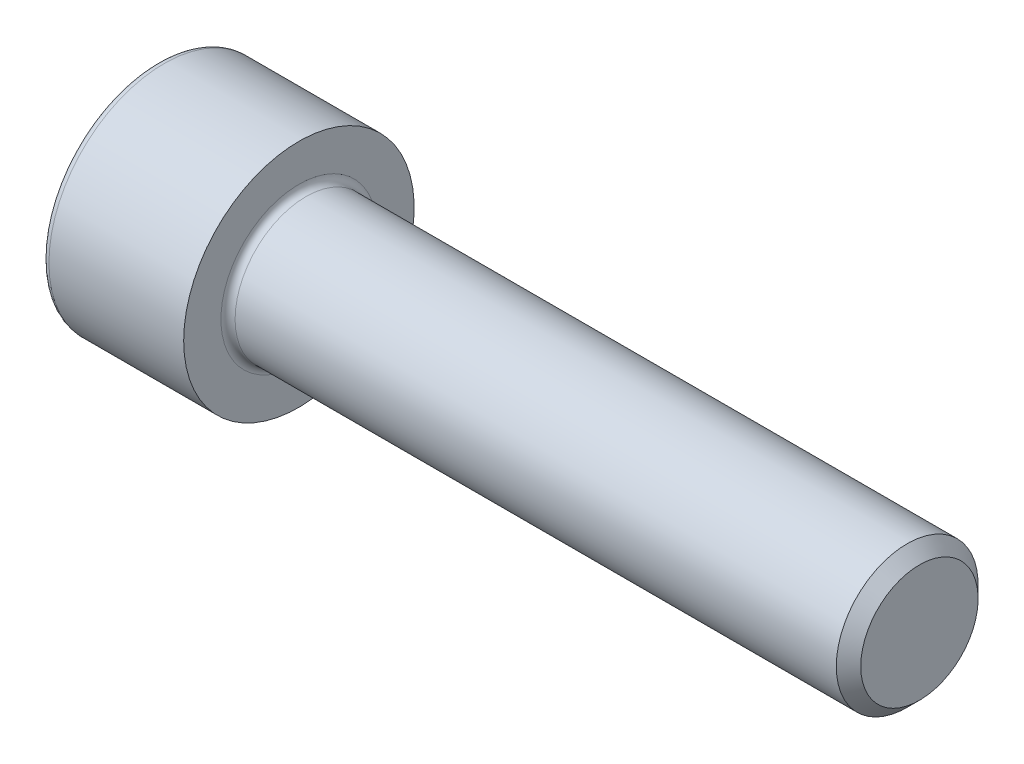
ISO-10303-21;
HEADER;
FILE_DESCRIPTION(('STEP AP214'),'2;1');
FILE_NAME('part.step','',(''),(''),'','','');
FILE_SCHEMA(('AUTOMOTIVE_DESIGN { 1 0 10303 214 1 1 1 1 }'));
ENDSEC;
DATA;
#1=APPLICATION_CONTEXT('core data for automotive mechanical design processes');
#2=APPLICATION_PROTOCOL_DEFINITION('international standard','automotive_design',2000,#1);
#3=PRODUCT_CONTEXT('',#1,'mechanical');
#4=PRODUCT('Part','Part','',(#3));
#5=PRODUCT_RELATED_PRODUCT_CATEGORY('part','',(#4));
#6=PRODUCT_DEFINITION_FORMATION('','',#4);
#7=PRODUCT_DEFINITION_CONTEXT('part definition',#1,'design');
#8=PRODUCT_DEFINITION('design','',#6,#7);
#9=PRODUCT_DEFINITION_SHAPE('','',#8);
#10=(LENGTH_UNIT() NAMED_UNIT(*) SI_UNIT(.MILLI.,.METRE.));
#11=(NAMED_UNIT(*) PLANE_ANGLE_UNIT() SI_UNIT($,.RADIAN.));
#12=(NAMED_UNIT(*) SI_UNIT($,.STERADIAN.) SOLID_ANGLE_UNIT());
#13=UNCERTAINTY_MEASURE_WITH_UNIT(LENGTH_MEASURE(1.E-05),#10,'distance_accuracy_value','');
#14=(GEOMETRIC_REPRESENTATION_CONTEXT(3) GLOBAL_UNCERTAINTY_ASSIGNED_CONTEXT((#13)) GLOBAL_UNIT_ASSIGNED_CONTEXT((#10,
#11,#12)) REPRESENTATION_CONTEXT('',''));
#15=CARTESIAN_POINT('',(0.,0.,0.));
#16=DIRECTION('',(0.,0.,1.));
#17=DIRECTION('',(1.,0.,0.));
#18=AXIS2_PLACEMENT_3D('',#15,#16,#17);
#19=CARTESIAN_POINT('',(0.,0.,0.));
#20=DIRECTION('',(-1.,0.,0.));
#21=DIRECTION('',(0.,0.,1.));
#22=AXIS2_PLACEMENT_3D('',#19,#20,#21);
#23=PLANE('',#22);
#24=DIRECTION('',(0.,-0.499999999999999,0.866025403784439));
#25=VECTOR('',#24,1.);
#26=CARTESIAN_POINT('',(0.,3.51894989071077,0.));
#27=LINE('',#26,#25);
#28=CARTESIAN_POINT('',(0.,3.51894989071077,0.));
#29=VERTEX_POINT('',#28);
#30=CARTESIAN_POINT('',(0.,1.75947494535538,3.0475));
#31=VERTEX_POINT('',#30);
#32=EDGE_CURVE('E258',#29,#31,#27,.T.);
#33=ORIENTED_EDGE('',*,*,#32,.T.);
#34=DIRECTION('',(0.,1.,0.));
#35=VECTOR('',#34,1.);
#36=CARTESIAN_POINT('',(0.,-1.75947494535539,3.0475));
#37=LINE('',#36,#35);
#38=CARTESIAN_POINT('',(0.,-1.75947494535539,3.0475));
#39=VERTEX_POINT('',#38);
#40=EDGE_CURVE('E130',#39,#31,#37,.T.);
#41=ORIENTED_EDGE('',*,*,#40,.F.);
#42=DIRECTION('',(0.,-0.500000000000001,-0.866025403784438));
#43=VECTOR('',#42,1.);
#44=CARTESIAN_POINT('',(0.,-1.75947494535539,3.0475));
#45=LINE('',#44,#43);
#46=CARTESIAN_POINT('',(0.,-3.51894989071077,0.));
#47=VERTEX_POINT('',#46);
#48=EDGE_CURVE('E261',#39,#47,#45,.T.);
#49=ORIENTED_EDGE('',*,*,#48,.T.);
#50=DIRECTION('',(0.,0.499999999999999,-0.866025403784439));
#51=VECTOR('',#50,1.);
#52=CARTESIAN_POINT('',(0.,-3.51894989071077,0.));
#53=LINE('',#52,#51);
#54=CARTESIAN_POINT('',(0.,-1.75947494535539,-3.0475));
#55=VERTEX_POINT('',#54);
#56=EDGE_CURVE('E264',#47,#55,#53,.T.);
#57=ORIENTED_EDGE('',*,*,#56,.T.);
#58=DIRECTION('',(0.,-1.,0.));
#59=VECTOR('',#58,1.);
#60=CARTESIAN_POINT('',(0.,1.75947494535538,-3.04750000000001));
#61=LINE('',#60,#59);
#62=CARTESIAN_POINT('',(0.,1.75947494535538,-3.04750000000001));
#63=VERTEX_POINT('',#62);
#64=EDGE_CURVE('E267',#63,#55,#61,.T.);
#65=ORIENTED_EDGE('',*,*,#64,.F.);
#66=DIRECTION('',(0.,-0.500000000000001,-0.866025403784438));
#67=VECTOR('',#66,1.);
#68=CARTESIAN_POINT('',(0.,3.51894989071077,0.));
#69=LINE('',#68,#67);
#70=EDGE_CURVE('E125',#29,#63,#69,.T.);
#71=ORIENTED_EDGE('',*,*,#70,.F.);
#72=EDGE_LOOP('',(#33,#41,#49,#57,#65,#71));
#73=FACE_BOUND('',#72,.T.);
#74=CARTESIAN_POINT('',(0.,0.,0.));
#75=DIRECTION('',(-1.,0.,0.));
#76=DIRECTION('',(0.,0.,1.));
#77=AXIS2_PLACEMENT_3D('',#74,#75,#76);
#78=CIRCLE('',#77,6.1);
#79=CARTESIAN_POINT('',(0.,0.,6.1));
#80=VERTEX_POINT('',#79);
#81=EDGE_CURVE('E42',#80,#80,#78,.T.);
#82=ORIENTED_EDGE('',*,*,#81,.T.);
#83=EDGE_LOOP('',(#82));
#84=FACE_BOUND('',#83,.T.);
#85=ADVANCED_FACE('F34',(#73,#84),#23,.T.);
#86=CARTESIAN_POINT('',(-31.75,0.,0.));
#87=DIRECTION('',(-1.,0.,0.));
#88=DIRECTION('',(0.,0.,1.));
#89=AXIS2_PLACEMENT_3D('',#86,#87,#88);
#90=CYLINDRICAL_SURFACE('',#89,6.5);
#91=CARTESIAN_POINT('',(0.399999999999998,0.,0.));
#92=DIRECTION('',(-1.,0.,0.));
#93=DIRECTION('',(0.,0.,1.));
#94=AXIS2_PLACEMENT_3D('',#91,#92,#93);
#95=CIRCLE('',#94,6.5);
#96=CARTESIAN_POINT('',(0.399999999999998,0.,6.5));
#97=VERTEX_POINT('',#96);
#98=EDGE_CURVE('E11',#97,#97,#95,.F.);
#99=ORIENTED_EDGE('',*,*,#98,.T.);
#100=EDGE_LOOP('',(#99));
#101=FACE_BOUND('',#100,.T.);
#102=CARTESIAN_POINT('',(8.,0.,0.));
#103=DIRECTION('',(-1.,0.,0.));
#104=DIRECTION('',(0.,0.,1.));
#105=AXIS2_PLACEMENT_3D('',#102,#103,#104);
#106=CIRCLE('',#105,6.5);
#107=CARTESIAN_POINT('',(8.,0.,6.5));
#108=VERTEX_POINT('',#107);
#109=EDGE_CURVE('E148',#108,#108,#106,.T.);
#110=ORIENTED_EDGE('',*,*,#109,.T.);
#111=EDGE_LOOP('',(#110));
#112=FACE_BOUND('',#111,.T.);
#113=ADVANCED_FACE('F172',(#101,#112),#90,.T.);
#114=CARTESIAN_POINT('',(8.,6.5,0.));
#115=DIRECTION('',(1.,0.,0.));
#116=DIRECTION('',(0.,0.,-1.));
#117=AXIS2_PLACEMENT_3D('',#114,#115,#116);
#118=PLANE('',#117);
#119=CARTESIAN_POINT('',(8.,0.,0.));
#120=DIRECTION('',(1.,0.,0.));
#121=DIRECTION('',(0.,0.,-1.));
#122=AXIS2_PLACEMENT_3D('',#119,#120,#121);
#123=CIRCLE('',#122,4.39999999999997);
#124=CARTESIAN_POINT('',(8.,0.,-4.39999999999997));
#125=VERTEX_POINT('',#124);
#126=EDGE_CURVE('E151',#125,#125,#123,.F.);
#127=ORIENTED_EDGE('',*,*,#126,.T.);
#128=EDGE_LOOP('',(#127));
#129=FACE_BOUND('',#128,.T.);
#130=ORIENTED_EDGE('',*,*,#109,.F.);
#131=EDGE_LOOP('',(#130));
#132=FACE_BOUND('',#131,.T.);
#133=ADVANCED_FACE('F178',(#129,#132),#118,.T.);
#134=CARTESIAN_POINT('',(-31.75,0.,0.));
#135=DIRECTION('',(-1.,0.,0.));
#136=DIRECTION('',(0.,0.,1.));
#137=AXIS2_PLACEMENT_3D('',#134,#135,#136);
#138=CYLINDRICAL_SURFACE('',#137,3.99999999999997);
#139=CARTESIAN_POINT('',(8.4,0.,0.));
#140=DIRECTION('',(1.,0.,0.));
#141=DIRECTION('',(0.,0.,-1.));
#142=AXIS2_PLACEMENT_3D('',#139,#140,#141);
#143=CIRCLE('',#142,3.99999999999997);
#144=CARTESIAN_POINT('',(8.4,0.,-3.99999999999997));
#145=VERTEX_POINT('',#144);
#146=EDGE_CURVE('E154',#145,#145,#143,.T.);
#147=ORIENTED_EDGE('',*,*,#146,.T.);
#148=EDGE_LOOP('',(#147));
#149=FACE_BOUND('',#148,.T.);
#150=CARTESIAN_POINT('',(42.3095,0.,0.));
#151=DIRECTION('',(-1.,0.,0.));
#152=DIRECTION('',(0.,0.,1.));
#153=AXIS2_PLACEMENT_3D('',#150,#151,#152);
#154=CIRCLE('',#153,3.99999999999994);
#155=CARTESIAN_POINT('',(42.3095,0.,3.99999999999994));
#156=VERTEX_POINT('',#155);
#157=EDGE_CURVE('E145',#156,#156,#154,.T.);
#158=ORIENTED_EDGE('',*,*,#157,.T.);
#159=EDGE_LOOP('',(#158));
#160=FACE_BOUND('',#159,.T.);
#161=ADVANCED_FACE('F184',(#149,#160),#138,.T.);
#162=CARTESIAN_POINT('',(43.,0.,0.));
#163=DIRECTION('',(-1.,0.,0.));
#164=DIRECTION('',(0.,0.,1.));
#165=AXIS2_PLACEMENT_3D('',#162,#163,#164);
#166=CONICAL_SURFACE('',#165,3.3095,0.785398163397391);
#167=ORIENTED_EDGE('',*,*,#157,.F.);
#168=EDGE_LOOP('',(#167));
#169=FACE_BOUND('',#168,.T.);
#170=CARTESIAN_POINT('',(43.,0.,0.));
#171=DIRECTION('',(-1.,0.,0.));
#172=DIRECTION('',(0.,0.,1.));
#173=AXIS2_PLACEMENT_3D('',#170,#171,#172);
#174=CIRCLE('',#173,3.3095);
#175=CARTESIAN_POINT('',(43.,0.,3.3095));
#176=VERTEX_POINT('',#175);
#177=EDGE_CURVE('E141',#176,#176,#174,.T.);
#178=ORIENTED_EDGE('',*,*,#177,.T.);
#179=EDGE_LOOP('',(#178));
#180=FACE_BOUND('',#179,.T.);
#181=ADVANCED_FACE('F188',(#169,#180),#166,.T.);
#182=CARTESIAN_POINT('',(43.,3.3095,0.));
#183=DIRECTION('',(1.,0.,0.));
#184=DIRECTION('',(0.,0.,-1.));
#185=AXIS2_PLACEMENT_3D('',#182,#183,#184);
#186=PLANE('',#185);
#187=ORIENTED_EDGE('',*,*,#177,.F.);
#188=EDGE_LOOP('',(#187));
#189=FACE_BOUND('',#188,.T.);
#190=ADVANCED_FACE('F168',(#189),#186,.T.);
#191=CARTESIAN_POINT('',(8.4,0.,0.));
#192=DIRECTION('',(1.,0.,0.));
#193=DIRECTION('',(0.,0.,-1.));
#194=AXIS2_PLACEMENT_3D('',#191,#192,#193);
#195=TOROIDAL_SURFACE('',#194,4.39999999999997,0.4);
#196=ORIENTED_EDGE('',*,*,#146,.F.);
#197=EDGE_LOOP('',(#196));
#198=FACE_BOUND('',#197,.T.);
#199=ORIENTED_EDGE('',*,*,#126,.F.);
#200=EDGE_LOOP('',(#199));
#201=FACE_BOUND('',#200,.T.);
#202=ADVANCED_FACE('F161',(#198,#201),#195,.F.);
#203=CARTESIAN_POINT('',(0.399999999999998,0.,0.));
#204=DIRECTION('',(-1.,0.,0.));
#205=DIRECTION('',(0.,0.,1.));
#206=AXIS2_PLACEMENT_3D('',#203,#204,#205);
#207=TOROIDAL_SURFACE('',#206,6.1,0.4);
#208=ORIENTED_EDGE('',*,*,#98,.F.);
#209=EDGE_LOOP('',(#208));
#210=FACE_BOUND('',#209,.T.);
#211=ORIENTED_EDGE('',*,*,#81,.F.);
#212=EDGE_LOOP('',(#211));
#213=FACE_BOUND('',#212,.T.);
#214=ADVANCED_FACE('F36',(#210,#213),#207,.T.);
#215=CARTESIAN_POINT('',(4.,3.51894989071077,0.));
#216=DIRECTION('',(0.,-0.866025403784439,-0.499999999999999));
#217=DIRECTION('',(0.,0.499999999999999,-0.866025403784439));
#218=AXIS2_PLACEMENT_3D('',#215,#216,#217);
#219=PLANE('',#218);
#220=ORIENTED_EDGE('',*,*,#32,.F.);
#221=DIRECTION('',(-1.,0.,0.));
#222=VECTOR('',#221,1.);
#223=CARTESIAN_POINT('',(4.,3.51894989071077,0.));
#224=LINE('',#223,#222);
#225=CARTESIAN_POINT('',(4.,3.51894989071077,0.));
#226=VERTEX_POINT('',#225);
#227=EDGE_CURVE('E248',#226,#29,#224,.T.);
#228=ORIENTED_EDGE('',*,*,#227,.F.);
#229=DIRECTION('',(0.,-0.499999999999999,0.866025403784439));
#230=VECTOR('',#229,1.);
#231=CARTESIAN_POINT('',(4.,3.51894989071077,0.));
#232=LINE('',#231,#230);
#233=CARTESIAN_POINT('',(4.,2.63921241803307,1.52375));
#234=VERTEX_POINT('',#233);
#235=EDGE_CURVE('E117',#226,#234,#232,.T.);
#236=ORIENTED_EDGE('',*,*,#235,.T.);
#237=CARTESIAN_POINT('',(4.,1.75947494535538,3.0475));
#238=VERTEX_POINT('',#237);
#239=EDGE_CURVE('E108',#234,#238,#232,.T.);
#240=ORIENTED_EDGE('',*,*,#239,.T.);
#241=DIRECTION('',(-1.,0.,0.));
#242=VECTOR('',#241,1.);
#243=CARTESIAN_POINT('',(4.,1.75947494535538,3.0475));
#244=LINE('',#243,#242);
#245=EDGE_CURVE('E122',#238,#31,#244,.T.);
#246=ORIENTED_EDGE('',*,*,#245,.T.);
#247=EDGE_LOOP('',(#220,#228,#236,#240,#246));
#248=FACE_BOUND('',#247,.T.);
#249=ADVANCED_FACE('F121',(#248),#219,.T.);
#250=CARTESIAN_POINT('',(4.,-1.75947494535539,3.0475));
#251=DIRECTION('',(0.,0.,1.));
#252=DIRECTION('',(0.,-1.,0.));
#253=AXIS2_PLACEMENT_3D('',#250,#251,#252);
#254=PLANE('',#253);
#255=ORIENTED_EDGE('',*,*,#40,.T.);
#256=ORIENTED_EDGE('',*,*,#245,.F.);
#257=DIRECTION('',(0.,1.,0.));
#258=VECTOR('',#257,1.);
#259=CARTESIAN_POINT('',(4.,-1.75947494535539,3.0475));
#260=LINE('',#259,#258);
#261=CARTESIAN_POINT('',(4.,0.,3.0475));
#262=VERTEX_POINT('',#261);
#263=EDGE_CURVE('E105',#262,#238,#260,.T.);
#264=ORIENTED_EDGE('',*,*,#263,.F.);
#265=CARTESIAN_POINT('',(4.,-1.75947494535539,3.0475));
#266=VERTEX_POINT('',#265);
#267=EDGE_CURVE('E116',#266,#262,#260,.T.);
#268=ORIENTED_EDGE('',*,*,#267,.F.);
#269=DIRECTION('',(-1.,0.,0.));
#270=VECTOR('',#269,1.);
#271=CARTESIAN_POINT('',(4.,-1.75947494535539,3.0475));
#272=LINE('',#271,#270);
#273=EDGE_CURVE('E132',#266,#39,#272,.T.);
#274=ORIENTED_EDGE('',*,*,#273,.T.);
#275=EDGE_LOOP('',(#255,#256,#264,#268,#274));
#276=FACE_BOUND('',#275,.T.);
#277=ADVANCED_FACE('F127',(#276),#254,.F.);
#278=CARTESIAN_POINT('',(4.,-1.75947494535539,3.0475));
#279=DIRECTION('',(0.,0.866025403784438,-0.500000000000001));
#280=DIRECTION('',(0.,0.500000000000001,0.866025403784438));
#281=AXIS2_PLACEMENT_3D('',#278,#279,#280);
#282=PLANE('',#281);
#283=ORIENTED_EDGE('',*,*,#48,.F.);
#284=ORIENTED_EDGE('',*,*,#273,.F.);
#285=DIRECTION('',(0.,-0.500000000000001,-0.866025403784438));
#286=VECTOR('',#285,1.);
#287=CARTESIAN_POINT('',(4.,-1.75947494535539,3.0475));
#288=LINE('',#287,#286);
#289=CARTESIAN_POINT('',(4.,-2.63921241803308,1.52375));
#290=VERTEX_POINT('',#289);
#291=EDGE_CURVE('E287',#266,#290,#288,.T.);
#292=ORIENTED_EDGE('',*,*,#291,.T.);
#293=CARTESIAN_POINT('',(4.,-3.51894989071077,0.));
#294=VERTEX_POINT('',#293);
#295=EDGE_CURVE('E276',#290,#294,#288,.T.);
#296=ORIENTED_EDGE('',*,*,#295,.T.);
#297=DIRECTION('',(-1.,0.,0.));
#298=VECTOR('',#297,1.);
#299=CARTESIAN_POINT('',(4.,-3.51894989071077,0.));
#300=LINE('',#299,#298);
#301=EDGE_CURVE('E137',#294,#47,#300,.T.);
#302=ORIENTED_EDGE('',*,*,#301,.T.);
#303=EDGE_LOOP('',(#283,#284,#292,#296,#302));
#304=FACE_BOUND('',#303,.T.);
#305=ADVANCED_FACE('F202',(#304),#282,.T.);
#306=CARTESIAN_POINT('',(4.,-3.51894989071077,0.));
#307=DIRECTION('',(0.,0.866025403784439,0.499999999999999));
#308=DIRECTION('',(0.,-0.499999999999999,0.866025403784439));
#309=AXIS2_PLACEMENT_3D('',#306,#307,#308);
#310=PLANE('',#309);
#311=ORIENTED_EDGE('',*,*,#56,.F.);
#312=ORIENTED_EDGE('',*,*,#301,.F.);
#313=DIRECTION('',(0.,0.499999999999999,-0.866025403784439));
#314=VECTOR('',#313,1.);
#315=CARTESIAN_POINT('',(4.,-3.51894989071077,0.));
#316=LINE('',#315,#314);
#317=CARTESIAN_POINT('',(4.,-2.63921241803308,-1.52375));
#318=VERTEX_POINT('',#317);
#319=EDGE_CURVE('E254',#294,#318,#316,.T.);
#320=ORIENTED_EDGE('',*,*,#319,.T.);
#321=CARTESIAN_POINT('',(4.,-1.75947494535539,-3.0475));
#322=VERTEX_POINT('',#321);
#323=EDGE_CURVE('E286',#318,#322,#316,.T.);
#324=ORIENTED_EDGE('',*,*,#323,.T.);
#325=DIRECTION('',(-1.,0.,0.));
#326=VECTOR('',#325,1.);
#327=CARTESIAN_POINT('',(4.,-1.75947494535539,-3.0475));
#328=LINE('',#327,#326);
#329=EDGE_CURVE('E247',#322,#55,#328,.T.);
#330=ORIENTED_EDGE('',*,*,#329,.T.);
#331=EDGE_LOOP('',(#311,#312,#320,#324,#330));
#332=FACE_BOUND('',#331,.T.);
#333=ADVANCED_FACE('F205',(#332),#310,.T.);
#334=CARTESIAN_POINT('',(4.,1.75947494535538,-3.04750000000001));
#335=DIRECTION('',(0.,0.,-1.));
#336=DIRECTION('',(0.,1.,0.));
#337=AXIS2_PLACEMENT_3D('',#334,#335,#336);
#338=PLANE('',#337);
#339=ORIENTED_EDGE('',*,*,#64,.T.);
#340=ORIENTED_EDGE('',*,*,#329,.F.);
#341=DIRECTION('',(0.,-1.,0.));
#342=VECTOR('',#341,1.);
#343=CARTESIAN_POINT('',(4.,1.75947494535538,-3.04750000000001));
#344=LINE('',#343,#342);
#345=CARTESIAN_POINT('',(4.,0.,-3.0475));
#346=VERTEX_POINT('',#345);
#347=EDGE_CURVE('E251',#346,#322,#344,.T.);
#348=ORIENTED_EDGE('',*,*,#347,.F.);
#349=CARTESIAN_POINT('',(4.,1.75947494535538,-3.04750000000001));
#350=VERTEX_POINT('',#349);
#351=EDGE_CURVE('E49',#350,#346,#344,.T.);
#352=ORIENTED_EDGE('',*,*,#351,.F.);
#353=DIRECTION('',(-1.,0.,0.));
#354=VECTOR('',#353,1.);
#355=CARTESIAN_POINT('',(4.,1.75947494535538,-3.04750000000001));
#356=LINE('',#355,#354);
#357=EDGE_CURVE('E244',#350,#63,#356,.T.);
#358=ORIENTED_EDGE('',*,*,#357,.T.);
#359=EDGE_LOOP('',(#339,#340,#348,#352,#358));
#360=FACE_BOUND('',#359,.T.);
#361=ADVANCED_FACE('F209',(#360),#338,.F.);
#362=CARTESIAN_POINT('',(4.,3.51894989071077,0.));
#363=DIRECTION('',(0.,0.866025403784438,-0.500000000000001));
#364=DIRECTION('',(0.,0.500000000000001,0.866025403784438));
#365=AXIS2_PLACEMENT_3D('',#362,#363,#364);
#366=PLANE('',#365);
#367=ORIENTED_EDGE('',*,*,#70,.T.);
#368=ORIENTED_EDGE('',*,*,#357,.F.);
#369=DIRECTION('',(0.,-0.500000000000001,-0.866025403784438));
#370=VECTOR('',#369,1.);
#371=CARTESIAN_POINT('',(4.,3.51894989071077,0.));
#372=LINE('',#371,#370);
#373=CARTESIAN_POINT('',(4.,2.63921241803307,-1.52375));
#374=VERTEX_POINT('',#373);
#375=EDGE_CURVE('E234',#374,#350,#372,.T.);
#376=ORIENTED_EDGE('',*,*,#375,.F.);
#377=EDGE_CURVE('E240',#226,#374,#372,.T.);
#378=ORIENTED_EDGE('',*,*,#377,.F.);
#379=ORIENTED_EDGE('',*,*,#227,.T.);
#380=EDGE_LOOP('',(#367,#368,#376,#378,#379));
#381=FACE_BOUND('',#380,.T.);
#382=ADVANCED_FACE('F213',(#381),#366,.F.);
#383=CARTESIAN_POINT('',(4.,3.51894989071077,0.));
#384=DIRECTION('',(1.,0.,0.));
#385=DIRECTION('',(0.,0.,-1.));
#386=AXIS2_PLACEMENT_3D('',#383,#384,#385);
#387=PLANE('',#386);
#388=ORIENTED_EDGE('',*,*,#347,.T.);
#389=ORIENTED_EDGE('',*,*,#323,.F.);
#390=CARTESIAN_POINT('',(4.,0.,0.));
#391=DIRECTION('',(-1.,0.,0.));
#392=DIRECTION('',(0.,0.,1.));
#393=AXIS2_PLACEMENT_3D('',#390,#391,#392);
#394=CIRCLE('',#393,3.0475);
#395=EDGE_CURVE('E282',#346,#318,#394,.T.);
#396=ORIENTED_EDGE('',*,*,#395,.F.);
#397=EDGE_LOOP('',(#388,#389,#396));
#398=FACE_BOUND('',#397,.T.);
#399=ADVANCED_FACE('F217',(#398),#387,.F.);
#400=ORIENTED_EDGE('',*,*,#319,.F.);
#401=ORIENTED_EDGE('',*,*,#295,.F.);
#402=EDGE_CURVE('E135',#318,#290,#394,.T.);
#403=ORIENTED_EDGE('',*,*,#402,.F.);
#404=EDGE_LOOP('',(#400,#401,#403));
#405=FACE_BOUND('',#404,.T.);
#406=ADVANCED_FACE('F220',(#405),#387,.F.);
#407=ORIENTED_EDGE('',*,*,#291,.F.);
#408=ORIENTED_EDGE('',*,*,#267,.T.);
#409=EDGE_CURVE('E131',#290,#262,#394,.T.);
#410=ORIENTED_EDGE('',*,*,#409,.F.);
#411=EDGE_LOOP('',(#407,#408,#410));
#412=FACE_BOUND('',#411,.T.);
#413=ADVANCED_FACE('F225',(#412),#387,.F.);
#414=ORIENTED_EDGE('',*,*,#263,.T.);
#415=ORIENTED_EDGE('',*,*,#239,.F.);
#416=EDGE_CURVE('E111',#262,#234,#394,.T.);
#417=ORIENTED_EDGE('',*,*,#416,.F.);
#418=EDGE_LOOP('',(#414,#415,#417));
#419=FACE_BOUND('',#418,.T.);
#420=ADVANCED_FACE('F107',(#419),#387,.F.);
#421=ORIENTED_EDGE('',*,*,#235,.F.);
#422=ORIENTED_EDGE('',*,*,#377,.T.);
#423=EDGE_CURVE('E142',#234,#374,#394,.T.);
#424=ORIENTED_EDGE('',*,*,#423,.F.);
#425=EDGE_LOOP('',(#421,#422,#424));
#426=FACE_BOUND('',#425,.T.);
#427=ADVANCED_FACE('F228',(#426),#387,.F.);
#428=ORIENTED_EDGE('',*,*,#375,.T.);
#429=ORIENTED_EDGE('',*,*,#351,.T.);
#430=EDGE_CURVE('E237',#374,#346,#394,.T.);
#431=ORIENTED_EDGE('',*,*,#430,.F.);
#432=EDGE_LOOP('',(#428,#429,#431));
#433=FACE_BOUND('',#432,.T.);
#434=ADVANCED_FACE('F198',(#433),#387,.F.);
#435=CARTESIAN_POINT('',(4.,0.,0.));
#436=DIRECTION('',(-1.,0.,0.));
#437=DIRECTION('',(0.,0.,1.));
#438=AXIS2_PLACEMENT_3D('',#435,#436,#437);
#439=CONICAL_SURFACE('',#438,3.0475,1.04719755119659);
#440=CARTESIAN_POINT('',(5.75947494535541,0.,0.));
#441=VERTEX_POINT('',#440);
#442=VERTEX_LOOP('',#441);
#443=FACE_BOUND('',#442,.T.);
#444=ORIENTED_EDGE('',*,*,#416,.T.);
#445=ORIENTED_EDGE('',*,*,#423,.T.);
#446=ORIENTED_EDGE('',*,*,#430,.T.);
#447=ORIENTED_EDGE('',*,*,#395,.T.);
#448=ORIENTED_EDGE('',*,*,#402,.T.);
#449=ORIENTED_EDGE('',*,*,#409,.T.);
#450=EDGE_LOOP('',(#444,#445,#446,#447,#448,#449));
#451=FACE_BOUND('',#450,.T.);
#452=ADVANCED_FACE('F196',(#443,#451),#439,.F.);
#453=CLOSED_SHELL('',(#85,#113,#133,#161,#181,#190,#202,#214,#249,#277,#305,#333,#361,#382,#399,
#406,#413,#420,#427,#434,#452));
#454=MANIFOLD_SOLID_BREP('B2',#453);
#455=ADVANCED_BREP_SHAPE_REPRESENTATION('',(#18,#454),#14);
#456=SHAPE_DEFINITION_REPRESENTATION(#9,#455);
ENDSEC;
END-ISO-10303-21;
